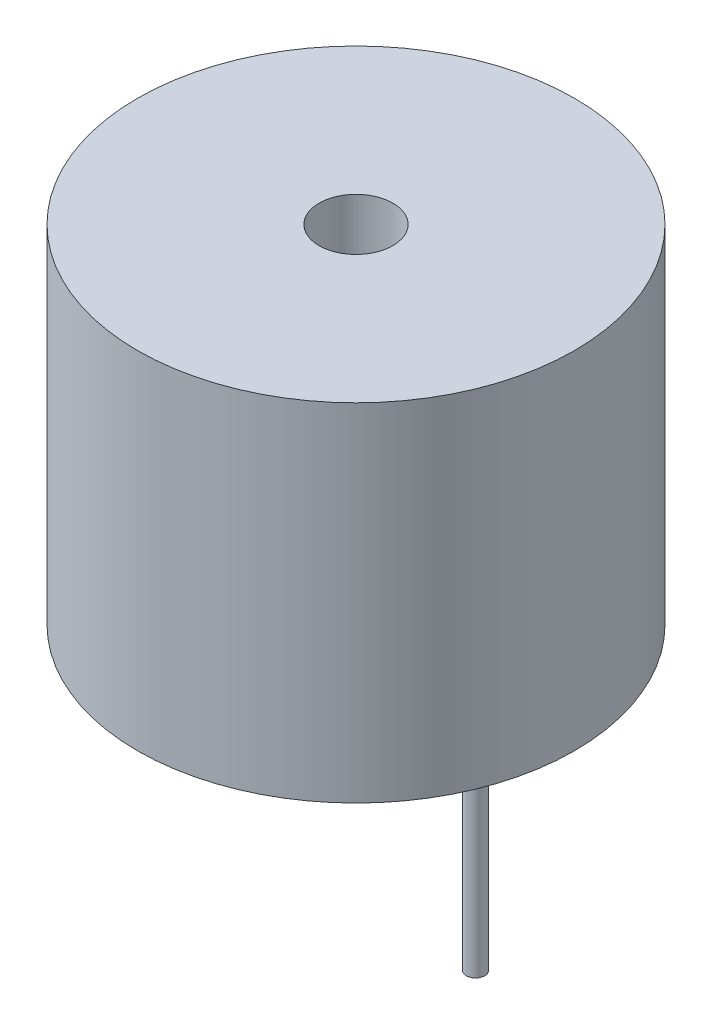
ISO-10303-21;
HEADER;
FILE_DESCRIPTION(('STEP AP214'),'2;1');
FILE_NAME('part.step','',(''),(''),'','','');
FILE_SCHEMA(('AUTOMOTIVE_DESIGN { 1 0 10303 214 1 1 1 1 }'));
ENDSEC;
DATA;
#1=APPLICATION_CONTEXT('core data for automotive mechanical design processes');
#2=APPLICATION_PROTOCOL_DEFINITION('international standard','automotive_design',2000,#1);
#3=PRODUCT_CONTEXT('',#1,'mechanical');
#4=PRODUCT('Part','Part','',(#3));
#5=PRODUCT_RELATED_PRODUCT_CATEGORY('part','',(#4));
#6=PRODUCT_DEFINITION_FORMATION('','',#4);
#7=PRODUCT_DEFINITION_CONTEXT('part definition',#1,'design');
#8=PRODUCT_DEFINITION('design','',#6,#7);
#9=PRODUCT_DEFINITION_SHAPE('','',#8);
#10=(LENGTH_UNIT() NAMED_UNIT(*) SI_UNIT(.MILLI.,.METRE.));
#11=(NAMED_UNIT(*) PLANE_ANGLE_UNIT() SI_UNIT($,.RADIAN.));
#12=(NAMED_UNIT(*) SI_UNIT($,.STERADIAN.) SOLID_ANGLE_UNIT());
#13=UNCERTAINTY_MEASURE_WITH_UNIT(LENGTH_MEASURE(1.E-05),#10,'distance_accuracy_value','');
#14=(GEOMETRIC_REPRESENTATION_CONTEXT(3) GLOBAL_UNCERTAINTY_ASSIGNED_CONTEXT((#13)) GLOBAL_UNIT_ASSIGNED_CONTEXT((#10,
#11,#12)) REPRESENTATION_CONTEXT('',''));
#15=CARTESIAN_POINT('',(0.,0.,0.));
#16=DIRECTION('',(0.,0.,1.));
#17=DIRECTION('',(1.,0.,0.));
#18=AXIS2_PLACEMENT_3D('',#15,#16,#17);
#19=CARTESIAN_POINT('',(0.,9.4,0.));
#20=DIRECTION('',(0.,-1.,0.));
#21=DIRECTION('',(0.,0.,-1.));
#22=AXIS2_PLACEMENT_3D('',#19,#20,#21);
#23=CYLINDRICAL_SURFACE('',#22,5.925);
#24=CARTESIAN_POINT('',(0.,9.4,0.));
#25=DIRECTION('',(0.,1.,0.));
#26=DIRECTION('',(0.,0.,1.));
#27=AXIS2_PLACEMENT_3D('',#24,#25,#26);
#28=CIRCLE('',#27,5.925);
#29=CARTESIAN_POINT('',(0.,9.4,5.925));
#30=VERTEX_POINT('',#29);
#31=EDGE_CURVE('E58',#30,#30,#28,.T.);
#32=ORIENTED_EDGE('',*,*,#31,.F.);
#33=EDGE_LOOP('',(#32));
#34=FACE_BOUND('',#33,.T.);
#35=CARTESIAN_POINT('',(0.,0.,0.));
#36=DIRECTION('',(0.,1.,0.));
#37=DIRECTION('',(0.,0.,1.));
#38=AXIS2_PLACEMENT_3D('',#35,#36,#37);
#39=CIRCLE('',#38,5.925);
#40=CARTESIAN_POINT('',(0.,0.,5.925));
#41=VERTEX_POINT('',#40);
#42=EDGE_CURVE('E62',#41,#41,#39,.T.);
#43=ORIENTED_EDGE('',*,*,#42,.T.);
#44=EDGE_LOOP('',(#43));
#45=FACE_BOUND('',#44,.T.);
#46=ADVANCED_FACE('F48',(#34,#45),#23,.T.);
#47=CARTESIAN_POINT('',(0.,9.4,0.));
#48=DIRECTION('',(0.,1.,0.));
#49=DIRECTION('',(0.,0.,1.));
#50=AXIS2_PLACEMENT_3D('',#47,#48,#49);
#51=PLANE('',#50);
#52=CARTESIAN_POINT('',(0.,9.4,0.));
#53=DIRECTION('',(0.,1.,0.));
#54=DIRECTION('',(0.,0.,1.));
#55=AXIS2_PLACEMENT_3D('',#52,#53,#54);
#56=CIRCLE('',#55,1.);
#57=CARTESIAN_POINT('',(0.,9.4,1.));
#58=VERTEX_POINT('',#57);
#59=EDGE_CURVE('E74',#58,#58,#56,.T.);
#60=ORIENTED_EDGE('',*,*,#59,.F.);
#61=EDGE_LOOP('',(#60));
#62=FACE_BOUND('',#61,.T.);
#63=ORIENTED_EDGE('',*,*,#31,.T.);
#64=EDGE_LOOP('',(#63));
#65=FACE_BOUND('',#64,.T.);
#66=ADVANCED_FACE('F89',(#62,#65),#51,.T.);
#67=CARTESIAN_POINT('',(0.,0.,0.));
#68=DIRECTION('',(0.,1.,0.));
#69=DIRECTION('',(0.,0.,1.));
#70=AXIS2_PLACEMENT_3D('',#67,#68,#69);
#71=PLANE('',#70);
#72=CARTESIAN_POINT('',(3.24178625430537,0.,0.));
#73=DIRECTION('',(0.,1.,0.));
#74=DIRECTION('',(0.,0.,1.));
#75=AXIS2_PLACEMENT_3D('',#72,#73,#74);
#76=CIRCLE('',#75,0.25);
#77=CARTESIAN_POINT('',(3.24178625430537,0.,0.25));
#78=VERTEX_POINT('',#77);
#79=EDGE_CURVE('E12',#78,#78,#76,.F.);
#80=ORIENTED_EDGE('',*,*,#79,.F.);
#81=EDGE_LOOP('',(#80));
#82=FACE_BOUND('',#81,.T.);
#83=CARTESIAN_POINT('',(-3.24178625430537,0.,0.));
#84=DIRECTION('',(0.,1.,0.));
#85=DIRECTION('',(0.,0.,1.));
#86=AXIS2_PLACEMENT_3D('',#83,#84,#85);
#87=CIRCLE('',#86,0.25);
#88=CARTESIAN_POINT('',(-3.24178625430537,0.,0.25));
#89=VERTEX_POINT('',#88);
#90=EDGE_CURVE('E54',#89,#89,#87,.F.);
#91=ORIENTED_EDGE('',*,*,#90,.F.);
#92=EDGE_LOOP('',(#91));
#93=FACE_BOUND('',#92,.T.);
#94=ORIENTED_EDGE('',*,*,#42,.F.);
#95=EDGE_LOOP('',(#94));
#96=FACE_BOUND('',#95,.T.);
#97=ADVANCED_FACE('F92',(#82,#93,#96),#71,.F.);
#98=CARTESIAN_POINT('',(-3.24178625430537,-4.9,0.));
#99=DIRECTION('',(0.,1.,0.));
#100=DIRECTION('',(0.,0.,1.));
#101=AXIS2_PLACEMENT_3D('',#98,#99,#100);
#102=CYLINDRICAL_SURFACE('',#101,0.25);
#103=CARTESIAN_POINT('',(-3.24178625430537,-4.9,0.));
#104=DIRECTION('',(0.,-1.,0.));
#105=DIRECTION('',(0.,0.,-1.));
#106=AXIS2_PLACEMENT_3D('',#103,#104,#105);
#107=CIRCLE('',#106,0.25);
#108=CARTESIAN_POINT('',(-3.24178625430537,-4.9,-0.25));
#109=VERTEX_POINT('',#108);
#110=EDGE_CURVE('E66',#109,#109,#107,.T.);
#111=ORIENTED_EDGE('',*,*,#110,.F.);
#112=EDGE_LOOP('',(#111));
#113=FACE_BOUND('',#112,.T.);
#114=ORIENTED_EDGE('',*,*,#90,.T.);
#115=EDGE_LOOP('',(#114));
#116=FACE_BOUND('',#115,.T.);
#117=ADVANCED_FACE('F101',(#113,#116),#102,.T.);
#118=CARTESIAN_POINT('',(-3.24178625430537,-4.9,0.));
#119=DIRECTION('',(0.,-1.,0.));
#120=DIRECTION('',(0.,0.,-1.));
#121=AXIS2_PLACEMENT_3D('',#118,#119,#120);
#122=PLANE('',#121);
#123=ORIENTED_EDGE('',*,*,#110,.T.);
#124=EDGE_LOOP('',(#123));
#125=FACE_BOUND('',#124,.T.);
#126=ADVANCED_FACE('F106',(#125),#122,.T.);
#127=CARTESIAN_POINT('',(3.24178625430537,-6.5,0.));
#128=DIRECTION('',(0.,1.,0.));
#129=DIRECTION('',(0.,0.,1.));
#130=AXIS2_PLACEMENT_3D('',#127,#128,#129);
#131=CYLINDRICAL_SURFACE('',#130,0.25);
#132=CARTESIAN_POINT('',(3.24178625430537,-6.5,0.));
#133=DIRECTION('',(0.,-1.,0.));
#134=DIRECTION('',(0.,0.,1.));
#135=AXIS2_PLACEMENT_3D('',#132,#133,#134);
#136=CIRCLE('',#135,0.25);
#137=CARTESIAN_POINT('',(3.24178625430537,-6.5,0.25));
#138=VERTEX_POINT('',#137);
#139=EDGE_CURVE('E70',#138,#138,#136,.T.);
#140=ORIENTED_EDGE('',*,*,#139,.F.);
#141=EDGE_LOOP('',(#140));
#142=FACE_BOUND('',#141,.T.);
#143=ORIENTED_EDGE('',*,*,#79,.T.);
#144=EDGE_LOOP('',(#143));
#145=FACE_BOUND('',#144,.T.);
#146=ADVANCED_FACE('F113',(#142,#145),#131,.T.);
#147=CARTESIAN_POINT('',(3.24178625430537,-6.5,0.));
#148=DIRECTION('',(0.,1.,0.));
#149=DIRECTION('',(0.,0.,1.));
#150=AXIS2_PLACEMENT_3D('',#147,#148,#149);
#151=PLANE('',#150);
#152=ORIENTED_EDGE('',*,*,#139,.T.);
#153=EDGE_LOOP('',(#152));
#154=FACE_BOUND('',#153,.T.);
#155=ADVANCED_FACE('F85',(#154),#151,.F.);
#156=CARTESIAN_POINT('',(0.,4.9,0.));
#157=DIRECTION('',(0.,1.,0.));
#158=DIRECTION('',(0.,0.,1.));
#159=AXIS2_PLACEMENT_3D('',#156,#157,#158);
#160=CYLINDRICAL_SURFACE('',#159,1.);
#161=CARTESIAN_POINT('',(0.,4.9,0.));
#162=DIRECTION('',(0.,1.,0.));
#163=DIRECTION('',(0.,0.,1.));
#164=AXIS2_PLACEMENT_3D('',#161,#162,#163);
#165=CIRCLE('',#164,1.);
#166=CARTESIAN_POINT('',(0.,4.9,1.));
#167=VERTEX_POINT('',#166);
#168=EDGE_CURVE('E73',#167,#167,#165,.T.);
#169=ORIENTED_EDGE('',*,*,#168,.F.);
#170=EDGE_LOOP('',(#169));
#171=FACE_BOUND('',#170,.T.);
#172=ORIENTED_EDGE('',*,*,#59,.T.);
#173=EDGE_LOOP('',(#172));
#174=FACE_BOUND('',#173,.T.);
#175=ADVANCED_FACE('F82',(#171,#174),#160,.F.);
#176=CARTESIAN_POINT('',(0.,4.9,0.));
#177=DIRECTION('',(0.,1.,0.));
#178=DIRECTION('',(0.,0.,1.));
#179=AXIS2_PLACEMENT_3D('',#176,#177,#178);
#180=PLANE('',#179);
#181=ORIENTED_EDGE('',*,*,#168,.T.);
#182=EDGE_LOOP('',(#181));
#183=FACE_BOUND('',#182,.T.);
#184=ADVANCED_FACE('F80',(#183),#180,.T.);
#185=CLOSED_SHELL('',(#46,#66,#97,#117,#126,#146,#155,#175,#184));
#186=MANIFOLD_SOLID_BREP('B2',#185);
#187=ADVANCED_BREP_SHAPE_REPRESENTATION('',(#18,#186),#14);
#188=SHAPE_DEFINITION_REPRESENTATION(#9,#187);
ENDSEC;
END-ISO-10303-21;
